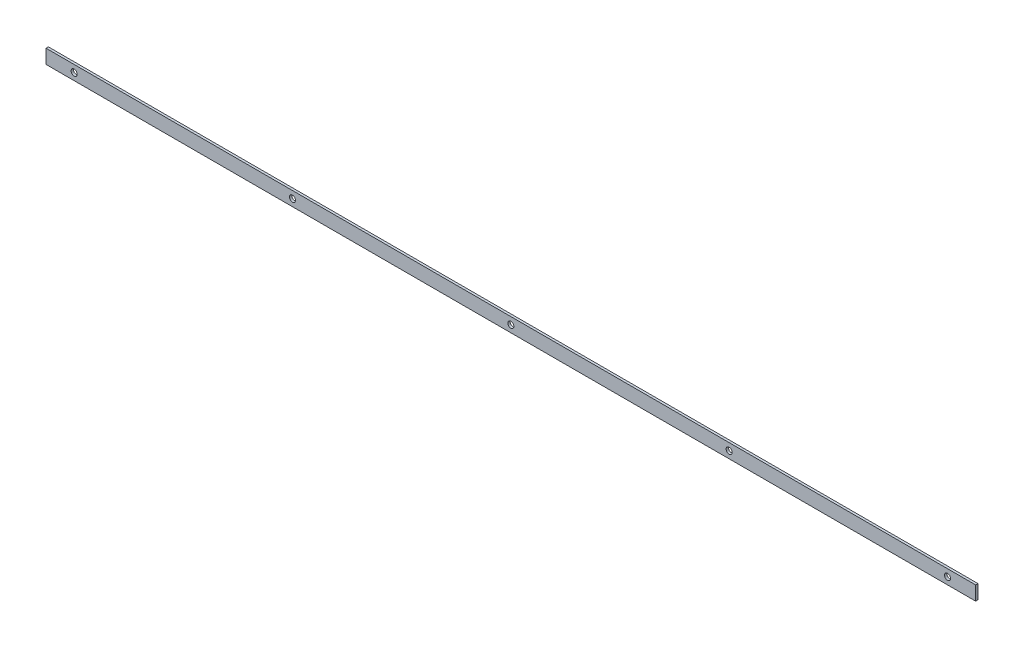
ISO-10303-21;
HEADER;
FILE_DESCRIPTION(('STEP AP214'),'2;1');
FILE_NAME('part.step','',(''),(''),'','','');
FILE_SCHEMA(('AUTOMOTIVE_DESIGN { 1 0 10303 214 1 1 1 1 }'));
ENDSEC;
DATA;
#1=APPLICATION_CONTEXT('core data for automotive mechanical design processes');
#2=APPLICATION_PROTOCOL_DEFINITION('international standard','automotive_design',2000,#1);
#3=PRODUCT_CONTEXT('',#1,'mechanical');
#4=PRODUCT('Part','Part','',(#3));
#5=PRODUCT_RELATED_PRODUCT_CATEGORY('part','',(#4));
#6=PRODUCT_DEFINITION_FORMATION('','',#4);
#7=PRODUCT_DEFINITION_CONTEXT('part definition',#1,'design');
#8=PRODUCT_DEFINITION('design','',#6,#7);
#9=PRODUCT_DEFINITION_SHAPE('','',#8);
#10=(LENGTH_UNIT() NAMED_UNIT(*) SI_UNIT(.MILLI.,.METRE.));
#11=(NAMED_UNIT(*) PLANE_ANGLE_UNIT() SI_UNIT($,.RADIAN.));
#12=(NAMED_UNIT(*) SI_UNIT($,.STERADIAN.) SOLID_ANGLE_UNIT());
#13=UNCERTAINTY_MEASURE_WITH_UNIT(LENGTH_MEASURE(1.E-05),#10,'distance_accuracy_value','');
#14=(GEOMETRIC_REPRESENTATION_CONTEXT(3) GLOBAL_UNCERTAINTY_ASSIGNED_CONTEXT((#13)) GLOBAL_UNIT_ASSIGNED_CONTEXT((#10,
#11,#12)) REPRESENTATION_CONTEXT('',''));
#15=CARTESIAN_POINT('',(0.,0.,0.));
#16=DIRECTION('',(0.,0.,1.));
#17=DIRECTION('',(1.,0.,0.));
#18=AXIS2_PLACEMENT_3D('',#15,#16,#17);
#19=CARTESIAN_POINT('',(931.5,0.,-2.5));
#20=DIRECTION('',(0.,0.,-1.));
#21=DIRECTION('',(-1.,0.,0.));
#22=AXIS2_PLACEMENT_3D('',#19,#20,#21);
#23=CYLINDRICAL_SURFACE('',#22,6.49999999999995);
#24=CARTESIAN_POINT('',(931.5,0.,2.5));
#25=DIRECTION('',(0.,0.,-1.));
#26=DIRECTION('',(-1.,0.,0.));
#27=AXIS2_PLACEMENT_3D('',#24,#25,#26);
#28=CIRCLE('',#27,6.49999999999995);
#29=CARTESIAN_POINT('',(925.,0.,2.5));
#30=VERTEX_POINT('',#29);
#31=EDGE_CURVE('E57',#30,#30,#28,.T.);
#32=ORIENTED_EDGE('',*,*,#31,.F.);
#33=EDGE_LOOP('',(#32));
#34=FACE_BOUND('',#33,.T.);
#35=CARTESIAN_POINT('',(931.5,0.,-2.5));
#36=DIRECTION('',(0.,0.,-1.));
#37=DIRECTION('',(-1.,0.,0.));
#38=AXIS2_PLACEMENT_3D('',#35,#36,#37);
#39=CIRCLE('',#38,6.49999999999995);
#40=CARTESIAN_POINT('',(925.,0.,-2.5));
#41=VERTEX_POINT('',#40);
#42=EDGE_CURVE('E12',#41,#41,#39,.T.);
#43=ORIENTED_EDGE('',*,*,#42,.T.);
#44=EDGE_LOOP('',(#43));
#45=FACE_BOUND('',#44,.T.);
#46=ADVANCED_FACE('F49',(#34,#45),#23,.F.);
#47=CARTESIAN_POINT('',(465.75,0.,-2.5));
#48=DIRECTION('',(0.,0.,-1.));
#49=DIRECTION('',(-1.,0.,0.));
#50=AXIS2_PLACEMENT_3D('',#47,#48,#49);
#51=CYLINDRICAL_SURFACE('',#50,6.49999999999995);
#52=CARTESIAN_POINT('',(465.75,0.,2.5));
#53=DIRECTION('',(0.,0.,-1.));
#54=DIRECTION('',(-1.,0.,0.));
#55=AXIS2_PLACEMENT_3D('',#52,#53,#54);
#56=CIRCLE('',#55,6.49999999999995);
#57=CARTESIAN_POINT('',(459.25,0.,2.5));
#58=VERTEX_POINT('',#57);
#59=EDGE_CURVE('E133',#58,#58,#56,.T.);
#60=ORIENTED_EDGE('',*,*,#59,.F.);
#61=EDGE_LOOP('',(#60));
#62=FACE_BOUND('',#61,.T.);
#63=CARTESIAN_POINT('',(465.75,0.,-2.5));
#64=DIRECTION('',(0.,0.,-1.));
#65=DIRECTION('',(-1.,0.,0.));
#66=AXIS2_PLACEMENT_3D('',#63,#64,#65);
#67=CIRCLE('',#66,6.49999999999995);
#68=CARTESIAN_POINT('',(459.25,0.,-2.5));
#69=VERTEX_POINT('',#68);
#70=EDGE_CURVE('E136',#69,#69,#67,.T.);
#71=ORIENTED_EDGE('',*,*,#70,.T.);
#72=EDGE_LOOP('',(#71));
#73=FACE_BOUND('',#72,.T.);
#74=ADVANCED_FACE('F145',(#62,#73),#51,.F.);
#75=CARTESIAN_POINT('',(0.,0.,-2.5));
#76=DIRECTION('',(0.,0.,-1.));
#77=DIRECTION('',(-1.,0.,0.));
#78=AXIS2_PLACEMENT_3D('',#75,#76,#77);
#79=CYLINDRICAL_SURFACE('',#78,6.49999999999995);
#80=CARTESIAN_POINT('',(0.,0.,2.5));
#81=DIRECTION('',(0.,0.,-1.));
#82=DIRECTION('',(-1.,0.,0.));
#83=AXIS2_PLACEMENT_3D('',#80,#81,#82);
#84=CIRCLE('',#83,6.49999999999995);
#85=CARTESIAN_POINT('',(-6.49999999999995,0.,2.5));
#86=VERTEX_POINT('',#85);
#87=EDGE_CURVE('E127',#86,#86,#84,.T.);
#88=ORIENTED_EDGE('',*,*,#87,.F.);
#89=EDGE_LOOP('',(#88));
#90=FACE_BOUND('',#89,.T.);
#91=CARTESIAN_POINT('',(0.,0.,-2.5));
#92=DIRECTION('',(0.,0.,-1.));
#93=DIRECTION('',(-1.,0.,0.));
#94=AXIS2_PLACEMENT_3D('',#91,#92,#93);
#95=CIRCLE('',#94,6.49999999999995);
#96=CARTESIAN_POINT('',(-6.49999999999995,0.,-2.5));
#97=VERTEX_POINT('',#96);
#98=EDGE_CURVE('E130',#97,#97,#95,.T.);
#99=ORIENTED_EDGE('',*,*,#98,.T.);
#100=EDGE_LOOP('',(#99));
#101=FACE_BOUND('',#100,.T.);
#102=ADVANCED_FACE('F157',(#90,#101),#79,.F.);
#103=CARTESIAN_POINT('',(991.5,-15.,2.5));
#104=DIRECTION('',(0.,1.,0.));
#105=DIRECTION('',(0.,0.,1.));
#106=AXIS2_PLACEMENT_3D('',#103,#104,#105);
#107=PLANE('',#106);
#108=DIRECTION('',(0.,0.,-1.));
#109=VECTOR('',#108,1.);
#110=CARTESIAN_POINT('',(-991.5,-15.,2.5));
#111=LINE('',#110,#109);
#112=CARTESIAN_POINT('',(-991.5,-15.,2.5));
#113=VERTEX_POINT('',#112);
#114=CARTESIAN_POINT('',(-991.5,-15.,-2.5));
#115=VERTEX_POINT('',#114);
#116=EDGE_CURVE('E117',#113,#115,#111,.T.);
#117=ORIENTED_EDGE('',*,*,#116,.T.);
#118=DIRECTION('',(-1.,0.,0.));
#119=VECTOR('',#118,1.);
#120=CARTESIAN_POINT('',(991.5,-15.,-2.5));
#121=LINE('',#120,#119);
#122=CARTESIAN_POINT('',(991.5,-15.,-2.5));
#123=VERTEX_POINT('',#122);
#124=EDGE_CURVE('E108',#123,#115,#121,.T.);
#125=ORIENTED_EDGE('',*,*,#124,.F.);
#126=DIRECTION('',(0.,0.,-1.));
#127=VECTOR('',#126,1.);
#128=CARTESIAN_POINT('',(991.5,-15.,2.5));
#129=LINE('',#128,#127);
#130=CARTESIAN_POINT('',(991.5,-15.,2.5));
#131=VERTEX_POINT('',#130);
#132=EDGE_CURVE('E101',#131,#123,#129,.T.);
#133=ORIENTED_EDGE('',*,*,#132,.F.);
#134=DIRECTION('',(-1.,0.,0.));
#135=VECTOR('',#134,1.);
#136=CARTESIAN_POINT('',(991.5,-15.,2.5));
#137=LINE('',#136,#135);
#138=EDGE_CURVE('E113',#131,#113,#137,.T.);
#139=ORIENTED_EDGE('',*,*,#138,.T.);
#140=EDGE_LOOP('',(#117,#125,#133,#139));
#141=FACE_BOUND('',#140,.T.);
#142=ADVANCED_FACE('F149',(#141),#107,.F.);
#143=CARTESIAN_POINT('',(991.5,-15.,-2.5));
#144=DIRECTION('',(0.,0.,1.));
#145=DIRECTION('',(1.,0.,0.));
#146=AXIS2_PLACEMENT_3D('',#143,#144,#145);
#147=PLANE('',#146);
#148=CARTESIAN_POINT('',(-465.75,0.,-2.5));
#149=DIRECTION('',(0.,0.,-1.));
#150=DIRECTION('',(-1.,0.,0.));
#151=AXIS2_PLACEMENT_3D('',#148,#149,#150);
#152=CIRCLE('',#151,6.49999999999995);
#153=CARTESIAN_POINT('',(-472.25,0.,-2.5));
#154=VERTEX_POINT('',#153);
#155=EDGE_CURVE('E201',#154,#154,#152,.T.);
#156=ORIENTED_EDGE('',*,*,#155,.F.);
#157=EDGE_LOOP('',(#156));
#158=FACE_BOUND('',#157,.T.);
#159=CARTESIAN_POINT('',(-931.5,0.,-2.5));
#160=DIRECTION('',(0.,0.,-1.));
#161=DIRECTION('',(-1.,0.,0.));
#162=AXIS2_PLACEMENT_3D('',#159,#160,#161);
#163=CIRCLE('',#162,6.49999999999995);
#164=CARTESIAN_POINT('',(-938.,0.,-2.5));
#165=VERTEX_POINT('',#164);
#166=EDGE_CURVE('E202',#165,#165,#163,.T.);
#167=ORIENTED_EDGE('',*,*,#166,.F.);
#168=EDGE_LOOP('',(#167));
#169=FACE_BOUND('',#168,.T.);
#170=DIRECTION('',(0.,1.,0.));
#171=VECTOR('',#170,1.);
#172=CARTESIAN_POINT('',(-991.5,-15.,-2.5));
#173=LINE('',#172,#171);
#174=CARTESIAN_POINT('',(-991.5,15.,-2.5));
#175=VERTEX_POINT('',#174);
#176=EDGE_CURVE('E107',#115,#175,#173,.T.);
#177=ORIENTED_EDGE('',*,*,#176,.T.);
#178=DIRECTION('',(-1.,0.,0.));
#179=VECTOR('',#178,1.);
#180=CARTESIAN_POINT('',(991.5,15.,-2.5));
#181=LINE('',#180,#179);
#182=CARTESIAN_POINT('',(991.5,15.,-2.5));
#183=VERTEX_POINT('',#182);
#184=EDGE_CURVE('E104',#183,#175,#181,.T.);
#185=ORIENTED_EDGE('',*,*,#184,.F.);
#186=DIRECTION('',(0.,1.,0.));
#187=VECTOR('',#186,1.);
#188=CARTESIAN_POINT('',(991.5,-15.,-2.5));
#189=LINE('',#188,#187);
#190=EDGE_CURVE('E96',#123,#183,#189,.T.);
#191=ORIENTED_EDGE('',*,*,#190,.F.);
#192=ORIENTED_EDGE('',*,*,#124,.T.);
#193=EDGE_LOOP('',(#177,#185,#191,#192));
#194=FACE_BOUND('',#193,.T.);
#195=ORIENTED_EDGE('',*,*,#98,.F.);
#196=EDGE_LOOP('',(#195));
#197=FACE_BOUND('',#196,.T.);
#198=ORIENTED_EDGE('',*,*,#70,.F.);
#199=EDGE_LOOP('',(#198));
#200=FACE_BOUND('',#199,.T.);
#201=ORIENTED_EDGE('',*,*,#42,.F.);
#202=EDGE_LOOP('',(#201));
#203=FACE_BOUND('',#202,.T.);
#204=ADVANCED_FACE('F105',(#158,#169,#194,#197,#200,#203),#147,.F.);
#205=CARTESIAN_POINT('',(991.5,15.,2.5));
#206=DIRECTION('',(0.,-1.,0.));
#207=DIRECTION('',(0.,0.,-1.));
#208=AXIS2_PLACEMENT_3D('',#205,#206,#207);
#209=PLANE('',#208);
#210=DIRECTION('',(0.,0.,1.));
#211=VECTOR('',#210,1.);
#212=CARTESIAN_POINT('',(-991.5,15.,2.5));
#213=LINE('',#212,#211);
#214=CARTESIAN_POINT('',(-991.5,15.,2.5));
#215=VERTEX_POINT('',#214);
#216=EDGE_CURVE('E82',#175,#215,#213,.T.);
#217=ORIENTED_EDGE('',*,*,#216,.T.);
#218=DIRECTION('',(-1.,0.,0.));
#219=VECTOR('',#218,1.);
#220=CARTESIAN_POINT('',(991.5,15.,2.5));
#221=LINE('',#220,#219);
#222=CARTESIAN_POINT('',(991.5,15.,2.5));
#223=VERTEX_POINT('',#222);
#224=EDGE_CURVE('E109',#223,#215,#221,.T.);
#225=ORIENTED_EDGE('',*,*,#224,.F.);
#226=DIRECTION('',(0.,0.,1.));
#227=VECTOR('',#226,1.);
#228=CARTESIAN_POINT('',(991.5,15.,2.5));
#229=LINE('',#228,#227);
#230=EDGE_CURVE('E99',#183,#223,#229,.T.);
#231=ORIENTED_EDGE('',*,*,#230,.F.);
#232=ORIENTED_EDGE('',*,*,#184,.T.);
#233=EDGE_LOOP('',(#217,#225,#231,#232));
#234=FACE_BOUND('',#233,.T.);
#235=ADVANCED_FACE('F111',(#234),#209,.F.);
#236=CARTESIAN_POINT('',(991.5,-15.,2.5));
#237=DIRECTION('',(0.,0.,-1.));
#238=DIRECTION('',(-1.,0.,0.));
#239=AXIS2_PLACEMENT_3D('',#236,#237,#238);
#240=PLANE('',#239);
#241=CARTESIAN_POINT('',(-465.75,0.,2.5));
#242=DIRECTION('',(0.,0.,-1.));
#243=DIRECTION('',(-1.,0.,0.));
#244=AXIS2_PLACEMENT_3D('',#241,#242,#243);
#245=CIRCLE('',#244,6.49999999999995);
#246=CARTESIAN_POINT('',(-472.25,0.,2.5));
#247=VERTEX_POINT('',#246);
#248=EDGE_CURVE('E199',#247,#247,#245,.T.);
#249=ORIENTED_EDGE('',*,*,#248,.T.);
#250=EDGE_LOOP('',(#249));
#251=FACE_BOUND('',#250,.T.);
#252=CARTESIAN_POINT('',(-931.5,0.,2.5));
#253=DIRECTION('',(0.,0.,-1.));
#254=DIRECTION('',(-1.,0.,0.));
#255=AXIS2_PLACEMENT_3D('',#252,#253,#254);
#256=CIRCLE('',#255,6.49999999999995);
#257=CARTESIAN_POINT('',(-938.,0.,2.5));
#258=VERTEX_POINT('',#257);
#259=EDGE_CURVE('E120',#258,#258,#256,.T.);
#260=ORIENTED_EDGE('',*,*,#259,.T.);
#261=EDGE_LOOP('',(#260));
#262=FACE_BOUND('',#261,.T.);
#263=DIRECTION('',(0.,-1.,0.));
#264=VECTOR('',#263,1.);
#265=CARTESIAN_POINT('',(-991.5,-15.,2.5));
#266=LINE('',#265,#264);
#267=EDGE_CURVE('E88',#215,#113,#266,.T.);
#268=ORIENTED_EDGE('',*,*,#267,.T.);
#269=ORIENTED_EDGE('',*,*,#138,.F.);
#270=DIRECTION('',(0.,-1.,0.));
#271=VECTOR('',#270,1.);
#272=CARTESIAN_POINT('',(991.5,-15.,2.5));
#273=LINE('',#272,#271);
#274=EDGE_CURVE('E65',#223,#131,#273,.T.);
#275=ORIENTED_EDGE('',*,*,#274,.F.);
#276=ORIENTED_EDGE('',*,*,#224,.T.);
#277=EDGE_LOOP('',(#268,#269,#275,#276));
#278=FACE_BOUND('',#277,.T.);
#279=ORIENTED_EDGE('',*,*,#87,.T.);
#280=EDGE_LOOP('',(#279));
#281=FACE_BOUND('',#280,.T.);
#282=ORIENTED_EDGE('',*,*,#59,.T.);
#283=EDGE_LOOP('',(#282));
#284=FACE_BOUND('',#283,.T.);
#285=ORIENTED_EDGE('',*,*,#31,.T.);
#286=EDGE_LOOP('',(#285));
#287=FACE_BOUND('',#286,.T.);
#288=ADVANCED_FACE('F141',(#251,#262,#278,#281,#284,#287),#240,.F.);
#289=CARTESIAN_POINT('',(991.5,-15.,-2.5));
#290=DIRECTION('',(1.,0.,0.));
#291=DIRECTION('',(0.,0.,-1.));
#292=AXIS2_PLACEMENT_3D('',#289,#290,#291);
#293=PLANE('',#292);
#294=ORIENTED_EDGE('',*,*,#132,.T.);
#295=ORIENTED_EDGE('',*,*,#190,.T.);
#296=ORIENTED_EDGE('',*,*,#230,.T.);
#297=ORIENTED_EDGE('',*,*,#274,.T.);
#298=EDGE_LOOP('',(#294,#295,#296,#297));
#299=FACE_BOUND('',#298,.T.);
#300=ADVANCED_FACE('F97',(#299),#293,.T.);
#301=CARTESIAN_POINT('',(-991.5,-15.,-2.5));
#302=DIRECTION('',(1.,0.,0.));
#303=DIRECTION('',(0.,0.,-1.));
#304=AXIS2_PLACEMENT_3D('',#301,#302,#303);
#305=PLANE('',#304);
#306=ORIENTED_EDGE('',*,*,#116,.F.);
#307=ORIENTED_EDGE('',*,*,#267,.F.);
#308=ORIENTED_EDGE('',*,*,#216,.F.);
#309=ORIENTED_EDGE('',*,*,#176,.F.);
#310=EDGE_LOOP('',(#306,#307,#308,#309));
#311=FACE_BOUND('',#310,.T.);
#312=ADVANCED_FACE('F180',(#311),#305,.F.);
#313=CARTESIAN_POINT('',(-931.5,0.,-2.5));
#314=DIRECTION('',(0.,0.,-1.));
#315=DIRECTION('',(-1.,0.,0.));
#316=AXIS2_PLACEMENT_3D('',#313,#314,#315);
#317=CYLINDRICAL_SURFACE('',#316,6.49999999999995);
#318=ORIENTED_EDGE('',*,*,#259,.F.);
#319=EDGE_LOOP('',(#318));
#320=FACE_BOUND('',#319,.T.);
#321=ORIENTED_EDGE('',*,*,#166,.T.);
#322=EDGE_LOOP('',(#321));
#323=FACE_BOUND('',#322,.T.);
#324=ADVANCED_FACE('F186',(#320,#323),#317,.F.);
#325=CARTESIAN_POINT('',(-465.75,0.,-2.5));
#326=DIRECTION('',(0.,0.,-1.));
#327=DIRECTION('',(-1.,0.,0.));
#328=AXIS2_PLACEMENT_3D('',#325,#326,#327);
#329=CYLINDRICAL_SURFACE('',#328,6.49999999999995);
#330=ORIENTED_EDGE('',*,*,#248,.F.);
#331=EDGE_LOOP('',(#330));
#332=FACE_BOUND('',#331,.T.);
#333=ORIENTED_EDGE('',*,*,#155,.T.);
#334=EDGE_LOOP('',(#333));
#335=FACE_BOUND('',#334,.T.);
#336=ADVANCED_FACE('F191',(#332,#335),#329,.F.);
#337=CLOSED_SHELL('',(#46,#74,#102,#142,#204,#235,#288,#300,#312,#324,#336));
#338=MANIFOLD_SOLID_BREP('B2',#337);
#339=ADVANCED_BREP_SHAPE_REPRESENTATION('',(#18,#338),#14);
#340=SHAPE_DEFINITION_REPRESENTATION(#9,#339);
ENDSEC;
END-ISO-10303-21;
